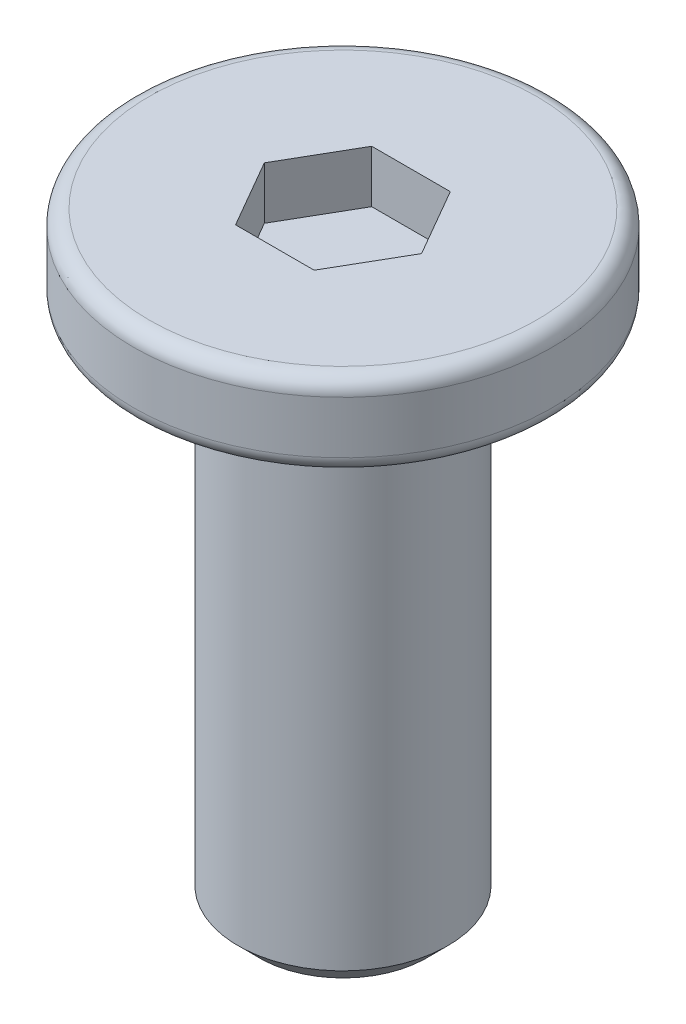
ISO-10303-21;
HEADER;
FILE_DESCRIPTION(('STEP AP214'),'2;1');
FILE_NAME('part.step','',(''),(''),'','','');
FILE_SCHEMA(('AUTOMOTIVE_DESIGN { 1 0 10303 214 1 1 1 1 }'));
ENDSEC;
DATA;
#1=APPLICATION_CONTEXT('core data for automotive mechanical design processes');
#2=APPLICATION_PROTOCOL_DEFINITION('international standard','automotive_design',2000,#1);
#3=PRODUCT_CONTEXT('',#1,'mechanical');
#4=PRODUCT('Part','Part','',(#3));
#5=PRODUCT_RELATED_PRODUCT_CATEGORY('part','',(#4));
#6=PRODUCT_DEFINITION_FORMATION('','',#4);
#7=PRODUCT_DEFINITION_CONTEXT('part definition',#1,'design');
#8=PRODUCT_DEFINITION('design','',#6,#7);
#9=PRODUCT_DEFINITION_SHAPE('','',#8);
#10=(LENGTH_UNIT() NAMED_UNIT(*) SI_UNIT(.MILLI.,.METRE.));
#11=(NAMED_UNIT(*) PLANE_ANGLE_UNIT() SI_UNIT($,.RADIAN.));
#12=(NAMED_UNIT(*) SI_UNIT($,.STERADIAN.) SOLID_ANGLE_UNIT());
#13=UNCERTAINTY_MEASURE_WITH_UNIT(LENGTH_MEASURE(1.E-05),#10,'distance_accuracy_value','');
#14=(GEOMETRIC_REPRESENTATION_CONTEXT(3) GLOBAL_UNCERTAINTY_ASSIGNED_CONTEXT((#13)) GLOBAL_UNIT_ASSIGNED_CONTEXT((#10,
#11,#12)) REPRESENTATION_CONTEXT('',''));
#15=CARTESIAN_POINT('',(0.,0.,0.));
#16=DIRECTION('',(0.,0.,1.));
#17=DIRECTION('',(1.,0.,0.));
#18=AXIS2_PLACEMENT_3D('',#15,#16,#17);
#19=CARTESIAN_POINT('',(0.,0.8,0.));
#20=DIRECTION('',(0.,-1.,0.));
#21=DIRECTION('',(0.,0.,-1.));
#22=AXIS2_PLACEMENT_3D('',#19,#20,#21);
#23=CYLINDRICAL_SURFACE('',#22,2.);
#24=CARTESIAN_POINT('',(0.,0.15,0.));
#25=DIRECTION('',(0.,1.,0.));
#26=DIRECTION('',(0.,0.,1.));
#27=AXIS2_PLACEMENT_3D('',#24,#25,#26);
#28=CIRCLE('',#27,2.);
#29=CARTESIAN_POINT('',(0.,0.15,2.));
#30=VERTEX_POINT('',#29);
#31=EDGE_CURVE('E152',#30,#30,#28,.T.);
#32=ORIENTED_EDGE('',*,*,#31,.T.);
#33=EDGE_LOOP('',(#32));
#34=FACE_BOUND('',#33,.T.);
#35=CARTESIAN_POINT('',(0.,0.65,0.));
#36=DIRECTION('',(0.,1.,0.));
#37=DIRECTION('',(0.,0.,1.));
#38=AXIS2_PLACEMENT_3D('',#35,#36,#37);
#39=CIRCLE('',#38,2.);
#40=CARTESIAN_POINT('',(0.,0.65,2.));
#41=VERTEX_POINT('',#40);
#42=EDGE_CURVE('E149',#41,#41,#39,.F.);
#43=ORIENTED_EDGE('',*,*,#42,.T.);
#44=EDGE_LOOP('',(#43));
#45=FACE_BOUND('',#44,.T.);
#46=ADVANCED_FACE('F38',(#34,#45),#23,.T.);
#47=CARTESIAN_POINT('',(0.,0.8,0.));
#48=DIRECTION('',(0.,1.,0.));
#49=DIRECTION('',(0.,0.,1.));
#50=AXIS2_PLACEMENT_3D('',#47,#48,#49);
#51=PLANE('',#50);
#52=DIRECTION('',(0.5,0.,-0.866025403784438));
#53=VECTOR('',#52,1.);
#54=CARTESIAN_POINT('',(0.375277674973257,0.8,0.65));
#55=LINE('',#54,#53);
#56=CARTESIAN_POINT('',(0.375277674973257,0.8,0.65));
#57=VERTEX_POINT('',#56);
#58=CARTESIAN_POINT('',(0.750555349946514,0.8,0.));
#59=VERTEX_POINT('',#58);
#60=EDGE_CURVE('E54',#57,#59,#55,.T.);
#61=ORIENTED_EDGE('',*,*,#60,.F.);
#62=DIRECTION('',(1.,0.,0.));
#63=VECTOR('',#62,1.);
#64=CARTESIAN_POINT('',(-0.375277674973257,0.8,0.65));
#65=LINE('',#64,#63);
#66=CARTESIAN_POINT('',(-0.375277674973257,0.8,0.65));
#67=VERTEX_POINT('',#66);
#68=EDGE_CURVE('E137',#67,#57,#65,.T.);
#69=ORIENTED_EDGE('',*,*,#68,.F.);
#70=DIRECTION('',(0.5,0.,0.866025403784438));
#71=VECTOR('',#70,1.);
#72=CARTESIAN_POINT('',(-0.750555349946514,0.8,0.));
#73=LINE('',#72,#71);
#74=CARTESIAN_POINT('',(-0.750555349946514,0.8,0.));
#75=VERTEX_POINT('',#74);
#76=EDGE_CURVE('E135',#75,#67,#73,.T.);
#77=ORIENTED_EDGE('',*,*,#76,.F.);
#78=DIRECTION('',(-0.5,0.,0.866025403784439));
#79=VECTOR('',#78,1.);
#80=CARTESIAN_POINT('',(-0.375277674973257,0.8,-0.65));
#81=LINE('',#80,#79);
#82=CARTESIAN_POINT('',(-0.375277674973257,0.8,-0.65));
#83=VERTEX_POINT('',#82);
#84=EDGE_CURVE('E102',#83,#75,#81,.T.);
#85=ORIENTED_EDGE('',*,*,#84,.F.);
#86=DIRECTION('',(-1.,0.,0.));
#87=VECTOR('',#86,1.);
#88=CARTESIAN_POINT('',(0.375277674973256,0.8,-0.65));
#89=LINE('',#88,#87);
#90=CARTESIAN_POINT('',(0.375277674973256,0.8,-0.65));
#91=VERTEX_POINT('',#90);
#92=EDGE_CURVE('E131',#91,#83,#89,.T.);
#93=ORIENTED_EDGE('',*,*,#92,.F.);
#94=DIRECTION('',(-0.5,0.,-0.866025403784438));
#95=VECTOR('',#94,1.);
#96=CARTESIAN_POINT('',(0.750555349946514,0.8,0.));
#97=LINE('',#96,#95);
#98=EDGE_CURVE('E128',#59,#91,#97,.T.);
#99=ORIENTED_EDGE('',*,*,#98,.F.);
#100=EDGE_LOOP('',(#61,#69,#77,#85,#93,#99));
#101=FACE_BOUND('',#100,.T.);
#102=CARTESIAN_POINT('',(0.,0.8,0.));
#103=DIRECTION('',(0.,1.,0.));
#104=DIRECTION('',(0.,0.,1.));
#105=AXIS2_PLACEMENT_3D('',#102,#103,#104);
#106=CIRCLE('',#105,1.85);
#107=CARTESIAN_POINT('',(0.,0.8,1.85));
#108=VERTEX_POINT('',#107);
#109=EDGE_CURVE('E158',#108,#108,#106,.T.);
#110=ORIENTED_EDGE('',*,*,#109,.T.);
#111=EDGE_LOOP('',(#110));
#112=FACE_BOUND('',#111,.T.);
#113=ADVANCED_FACE('F179',(#101,#112),#51,.T.);
#114=CARTESIAN_POINT('',(0.,0.,0.));
#115=DIRECTION('',(0.,1.,0.));
#116=DIRECTION('',(0.,0.,1.));
#117=AXIS2_PLACEMENT_3D('',#114,#115,#116);
#118=PLANE('',#117);
#119=CARTESIAN_POINT('',(0.,0.,0.));
#120=DIRECTION('',(0.,1.,0.));
#121=DIRECTION('',(0.,0.,1.));
#122=AXIS2_PLACEMENT_3D('',#119,#120,#121);
#123=CIRCLE('',#122,1.85);
#124=CARTESIAN_POINT('',(0.,0.,1.85));
#125=VERTEX_POINT('',#124);
#126=EDGE_CURVE('E155',#125,#125,#123,.F.);
#127=ORIENTED_EDGE('',*,*,#126,.T.);
#128=EDGE_LOOP('',(#127));
#129=FACE_BOUND('',#128,.T.);
#130=CARTESIAN_POINT('',(0.,0.,0.));
#131=DIRECTION('',(0.,-1.,0.));
#132=DIRECTION('',(0.,0.,-1.));
#133=AXIS2_PLACEMENT_3D('',#130,#131,#132);
#134=CIRCLE('',#133,1.);
#135=CARTESIAN_POINT('',(0.,0.,-1.));
#136=VERTEX_POINT('',#135);
#137=EDGE_CURVE('E141',#136,#136,#134,.T.);
#138=ORIENTED_EDGE('',*,*,#137,.F.);
#139=EDGE_LOOP('',(#138));
#140=FACE_BOUND('',#139,.T.);
#141=ADVANCED_FACE('F185',(#129,#140),#118,.F.);
#142=CARTESIAN_POINT('',(0.,-5.,0.));
#143=DIRECTION('',(0.,1.,0.));
#144=DIRECTION('',(0.,0.,1.));
#145=AXIS2_PLACEMENT_3D('',#142,#143,#144);
#146=CYLINDRICAL_SURFACE('',#145,1.);
#147=CARTESIAN_POINT('',(0.,-4.8,0.));
#148=DIRECTION('',(0.,-1.,0.));
#149=DIRECTION('',(0.,0.,-1.));
#150=AXIS2_PLACEMENT_3D('',#147,#148,#149);
#151=CIRCLE('',#150,1.);
#152=CARTESIAN_POINT('',(0.,-4.8,-1.));
#153=VERTEX_POINT('',#152);
#154=EDGE_CURVE('E11',#153,#153,#151,.F.);
#155=ORIENTED_EDGE('',*,*,#154,.T.);
#156=EDGE_LOOP('',(#155));
#157=FACE_BOUND('',#156,.T.);
#158=ORIENTED_EDGE('',*,*,#137,.T.);
#159=EDGE_LOOP('',(#158));
#160=FACE_BOUND('',#159,.T.);
#161=ADVANCED_FACE('F196',(#157,#160),#146,.T.);
#162=CARTESIAN_POINT('',(0.,-5.,0.));
#163=DIRECTION('',(0.,-1.,0.));
#164=DIRECTION('',(0.,0.,-1.));
#165=AXIS2_PLACEMENT_3D('',#162,#163,#164);
#166=PLANE('',#165);
#167=CARTESIAN_POINT('',(0.,-5.,0.));
#168=DIRECTION('',(0.,-1.,0.));
#169=DIRECTION('',(0.,0.,-1.));
#170=AXIS2_PLACEMENT_3D('',#167,#168,#169);
#171=CIRCLE('',#170,0.8);
#172=CARTESIAN_POINT('',(0.,-5.,-0.8));
#173=VERTEX_POINT('',#172);
#174=EDGE_CURVE('E47',#173,#173,#171,.T.);
#175=ORIENTED_EDGE('',*,*,#174,.T.);
#176=EDGE_LOOP('',(#175));
#177=FACE_BOUND('',#176,.T.);
#178=ADVANCED_FACE('F163',(#177),#166,.T.);
#179=CARTESIAN_POINT('',(0.,0.15,0.));
#180=DIRECTION('',(0.,1.,0.));
#181=DIRECTION('',(0.,0.,1.));
#182=AXIS2_PLACEMENT_3D('',#179,#180,#181);
#183=TOROIDAL_SURFACE('',#182,1.85,0.15);
#184=ORIENTED_EDGE('',*,*,#126,.F.);
#185=EDGE_LOOP('',(#184));
#186=FACE_BOUND('',#185,.T.);
#187=ORIENTED_EDGE('',*,*,#31,.F.);
#188=EDGE_LOOP('',(#187));
#189=FACE_BOUND('',#188,.T.);
#190=ADVANCED_FACE('F175',(#186,#189),#183,.T.);
#191=CARTESIAN_POINT('',(0.,0.65,0.));
#192=DIRECTION('',(0.,1.,0.));
#193=DIRECTION('',(0.,0.,1.));
#194=AXIS2_PLACEMENT_3D('',#191,#192,#193);
#195=TOROIDAL_SURFACE('',#194,1.85,0.15);
#196=ORIENTED_EDGE('',*,*,#42,.F.);
#197=EDGE_LOOP('',(#196));
#198=FACE_BOUND('',#197,.T.);
#199=ORIENTED_EDGE('',*,*,#109,.F.);
#200=EDGE_LOOP('',(#199));
#201=FACE_BOUND('',#200,.T.);
#202=ADVANCED_FACE('F167',(#198,#201),#195,.T.);
#203=CARTESIAN_POINT('',(0.,-5.,0.));
#204=DIRECTION('',(0.,1.,0.));
#205=DIRECTION('',(0.,0.,1.));
#206=AXIS2_PLACEMENT_3D('',#203,#204,#205);
#207=CONICAL_SURFACE('',#206,0.8,0.785398163397444);
#208=ORIENTED_EDGE('',*,*,#154,.F.);
#209=EDGE_LOOP('',(#208));
#210=FACE_BOUND('',#209,.T.);
#211=ORIENTED_EDGE('',*,*,#174,.F.);
#212=EDGE_LOOP('',(#211));
#213=FACE_BOUND('',#212,.T.);
#214=ADVANCED_FACE('F41',(#210,#213),#207,.T.);
#215=CARTESIAN_POINT('',(0.375277674973257,0.3,0.65));
#216=DIRECTION('',(0.866025403784439,0.,0.5));
#217=DIRECTION('',(0.5,0.,-0.866025403784439));
#218=AXIS2_PLACEMENT_3D('',#215,#216,#217);
#219=PLANE('',#218);
#220=ORIENTED_EDGE('',*,*,#60,.T.);
#221=DIRECTION('',(0.,1.,0.));
#222=VECTOR('',#221,1.);
#223=CARTESIAN_POINT('',(0.750555349946514,0.3,0.));
#224=LINE('',#223,#222);
#225=CARTESIAN_POINT('',(0.750555349946514,0.3,0.));
#226=VERTEX_POINT('',#225);
#227=EDGE_CURVE('E84',#226,#59,#224,.T.);
#228=ORIENTED_EDGE('',*,*,#227,.F.);
#229=DIRECTION('',(0.5,0.,-0.866025403784438));
#230=VECTOR('',#229,1.);
#231=CARTESIAN_POINT('',(0.375277674973257,0.3,0.65));
#232=LINE('',#231,#230);
#233=CARTESIAN_POINT('',(0.375277674973257,0.3,0.65));
#234=VERTEX_POINT('',#233);
#235=EDGE_CURVE('E139',#234,#226,#232,.T.);
#236=ORIENTED_EDGE('',*,*,#235,.F.);
#237=DIRECTION('',(0.,1.,0.));
#238=VECTOR('',#237,1.);
#239=CARTESIAN_POINT('',(0.375277674973257,0.3,0.65));
#240=LINE('',#239,#238);
#241=EDGE_CURVE('E62',#234,#57,#240,.T.);
#242=ORIENTED_EDGE('',*,*,#241,.T.);
#243=EDGE_LOOP('',(#220,#228,#236,#242));
#244=FACE_BOUND('',#243,.T.);
#245=ADVANCED_FACE('F166',(#244),#219,.F.);
#246=CARTESIAN_POINT('',(-0.375277674973257,0.3,0.65));
#247=DIRECTION('',(0.,0.,1.));
#248=DIRECTION('',(1.,0.,0.));
#249=AXIS2_PLACEMENT_3D('',#246,#247,#248);
#250=PLANE('',#249);
#251=ORIENTED_EDGE('',*,*,#68,.T.);
#252=ORIENTED_EDGE('',*,*,#241,.F.);
#253=DIRECTION('',(1.,0.,0.));
#254=VECTOR('',#253,1.);
#255=CARTESIAN_POINT('',(-0.375277674973257,0.3,0.65));
#256=LINE('',#255,#254);
#257=CARTESIAN_POINT('',(-0.375277674973257,0.3,0.65));
#258=VERTEX_POINT('',#257);
#259=EDGE_CURVE('E114',#258,#234,#256,.T.);
#260=ORIENTED_EDGE('',*,*,#259,.F.);
#261=DIRECTION('',(0.,1.,0.));
#262=VECTOR('',#261,1.);
#263=CARTESIAN_POINT('',(-0.375277674973257,0.3,0.65));
#264=LINE('',#263,#262);
#265=EDGE_CURVE('E106',#258,#67,#264,.T.);
#266=ORIENTED_EDGE('',*,*,#265,.T.);
#267=EDGE_LOOP('',(#251,#252,#260,#266));
#268=FACE_BOUND('',#267,.T.);
#269=ADVANCED_FACE('F173',(#268),#250,.F.);
#270=CARTESIAN_POINT('',(-0.750555349946514,0.3,0.));
#271=DIRECTION('',(-0.866025403784438,0.,0.5));
#272=DIRECTION('',(0.5,0.,0.866025403784439));
#273=AXIS2_PLACEMENT_3D('',#270,#271,#272);
#274=PLANE('',#273);
#275=ORIENTED_EDGE('',*,*,#76,.T.);
#276=ORIENTED_EDGE('',*,*,#265,.F.);
#277=DIRECTION('',(0.5,0.,0.866025403784438));
#278=VECTOR('',#277,1.);
#279=CARTESIAN_POINT('',(-0.750555349946514,0.3,0.));
#280=LINE('',#279,#278);
#281=CARTESIAN_POINT('',(-0.750555349946514,0.3,0.));
#282=VERTEX_POINT('',#281);
#283=EDGE_CURVE('E110',#282,#258,#280,.T.);
#284=ORIENTED_EDGE('',*,*,#283,.F.);
#285=DIRECTION('',(0.,1.,0.));
#286=VECTOR('',#285,1.);
#287=CARTESIAN_POINT('',(-0.750555349946514,0.3,0.));
#288=LINE('',#287,#286);
#289=EDGE_CURVE('E95',#282,#75,#288,.T.);
#290=ORIENTED_EDGE('',*,*,#289,.T.);
#291=EDGE_LOOP('',(#275,#276,#284,#290));
#292=FACE_BOUND('',#291,.T.);
#293=ADVANCED_FACE('F111',(#292),#274,.F.);
#294=CARTESIAN_POINT('',(-0.375277674973257,0.3,-0.65));
#295=DIRECTION('',(-0.866025403784439,0.,-0.5));
#296=DIRECTION('',(-0.5,0.,0.866025403784439));
#297=AXIS2_PLACEMENT_3D('',#294,#295,#296);
#298=PLANE('',#297);
#299=ORIENTED_EDGE('',*,*,#84,.T.);
#300=ORIENTED_EDGE('',*,*,#289,.F.);
#301=DIRECTION('',(-0.5,0.,0.866025403784439));
#302=VECTOR('',#301,1.);
#303=CARTESIAN_POINT('',(-0.375277674973257,0.3,-0.65));
#304=LINE('',#303,#302);
#305=CARTESIAN_POINT('',(-0.375277674973257,0.3,-0.65));
#306=VERTEX_POINT('',#305);
#307=EDGE_CURVE('E99',#306,#282,#304,.T.);
#308=ORIENTED_EDGE('',*,*,#307,.F.);
#309=DIRECTION('',(0.,1.,0.));
#310=VECTOR('',#309,1.);
#311=CARTESIAN_POINT('',(-0.375277674973257,0.3,-0.65));
#312=LINE('',#311,#310);
#313=EDGE_CURVE('E107',#306,#83,#312,.T.);
#314=ORIENTED_EDGE('',*,*,#313,.T.);
#315=EDGE_LOOP('',(#299,#300,#308,#314));
#316=FACE_BOUND('',#315,.T.);
#317=ADVANCED_FACE('F97',(#316),#298,.F.);
#318=CARTESIAN_POINT('',(0.375277674973256,0.3,-0.65));
#319=DIRECTION('',(0.,0.,-1.));
#320=DIRECTION('',(-1.,0.,0.));
#321=AXIS2_PLACEMENT_3D('',#318,#319,#320);
#322=PLANE('',#321);
#323=ORIENTED_EDGE('',*,*,#92,.T.);
#324=ORIENTED_EDGE('',*,*,#313,.F.);
#325=DIRECTION('',(-1.,0.,0.));
#326=VECTOR('',#325,1.);
#327=CARTESIAN_POINT('',(0.375277674973256,0.3,-0.65));
#328=LINE('',#327,#326);
#329=CARTESIAN_POINT('',(0.375277674973256,0.3,-0.65));
#330=VERTEX_POINT('',#329);
#331=EDGE_CURVE('E120',#330,#306,#328,.T.);
#332=ORIENTED_EDGE('',*,*,#331,.F.);
#333=DIRECTION('',(0.,1.,0.));
#334=VECTOR('',#333,1.);
#335=CARTESIAN_POINT('',(0.375277674973256,0.3,-0.65));
#336=LINE('',#335,#334);
#337=EDGE_CURVE('E144',#330,#91,#336,.T.);
#338=ORIENTED_EDGE('',*,*,#337,.T.);
#339=EDGE_LOOP('',(#323,#324,#332,#338));
#340=FACE_BOUND('',#339,.T.);
#341=ADVANCED_FACE('F215',(#340),#322,.F.);
#342=CARTESIAN_POINT('',(0.750555349946514,0.3,0.));
#343=DIRECTION('',(0.866025403784438,0.,-0.5));
#344=DIRECTION('',(-0.5,0.,-0.866025403784439));
#345=AXIS2_PLACEMENT_3D('',#342,#343,#344);
#346=PLANE('',#345);
#347=ORIENTED_EDGE('',*,*,#98,.T.);
#348=ORIENTED_EDGE('',*,*,#337,.F.);
#349=DIRECTION('',(-0.5,0.,-0.866025403784438));
#350=VECTOR('',#349,1.);
#351=CARTESIAN_POINT('',(0.750555349946514,0.3,0.));
#352=LINE('',#351,#350);
#353=EDGE_CURVE('E122',#226,#330,#352,.T.);
#354=ORIENTED_EDGE('',*,*,#353,.F.);
#355=ORIENTED_EDGE('',*,*,#227,.T.);
#356=EDGE_LOOP('',(#347,#348,#354,#355));
#357=FACE_BOUND('',#356,.T.);
#358=ADVANCED_FACE('F212',(#357),#346,.F.);
#359=CARTESIAN_POINT('',(0.,0.3,0.));
#360=DIRECTION('',(0.,1.,0.));
#361=DIRECTION('',(0.,0.,1.));
#362=AXIS2_PLACEMENT_3D('',#359,#360,#361);
#363=PLANE('',#362);
#364=ORIENTED_EDGE('',*,*,#235,.T.);
#365=ORIENTED_EDGE('',*,*,#353,.T.);
#366=ORIENTED_EDGE('',*,*,#331,.T.);
#367=ORIENTED_EDGE('',*,*,#307,.T.);
#368=ORIENTED_EDGE('',*,*,#283,.T.);
#369=ORIENTED_EDGE('',*,*,#259,.T.);
#370=EDGE_LOOP('',(#364,#365,#366,#367,#368,#369));
#371=FACE_BOUND('',#370,.T.);
#372=ADVANCED_FACE('F117',(#371),#363,.T.);
#373=CLOSED_SHELL('',(#46,#113,#141,#161,#178,#190,#202,#214,#245,#269,#293,#317,#341,#358,#372));
#374=MANIFOLD_SOLID_BREP('B2',#373);
#375=ADVANCED_BREP_SHAPE_REPRESENTATION('',(#18,#374),#14);
#376=SHAPE_DEFINITION_REPRESENTATION(#9,#375);
ENDSEC;
END-ISO-10303-21;
